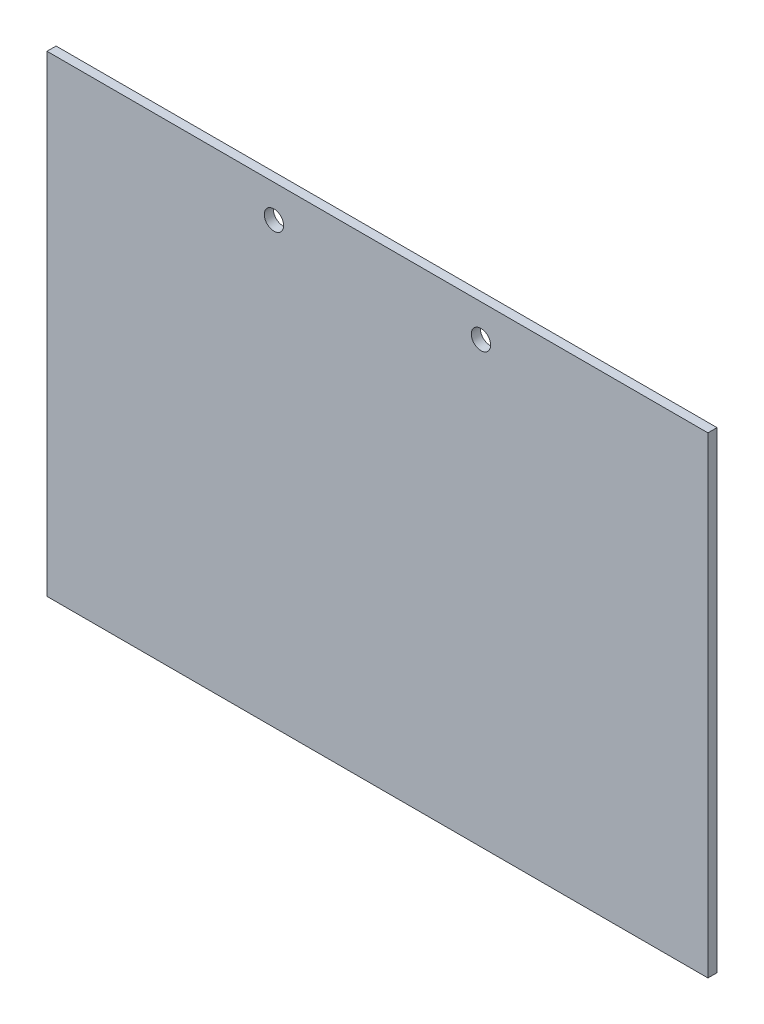
ISO-10303-21;
HEADER;
FILE_DESCRIPTION(('STEP AP214'),'2;1');
FILE_NAME('part.step','',(''),(''),'','','');
FILE_SCHEMA(('AUTOMOTIVE_DESIGN { 1 0 10303 214 1 1 1 1 }'));
ENDSEC;
DATA;
#1=APPLICATION_CONTEXT('core data for automotive mechanical design processes');
#2=APPLICATION_PROTOCOL_DEFINITION('international standard','automotive_design',2000,#1);
#3=PRODUCT_CONTEXT('',#1,'mechanical');
#4=PRODUCT('Part','Part','',(#3));
#5=PRODUCT_RELATED_PRODUCT_CATEGORY('part','',(#4));
#6=PRODUCT_DEFINITION_FORMATION('','',#4);
#7=PRODUCT_DEFINITION_CONTEXT('part definition',#1,'design');
#8=PRODUCT_DEFINITION('design','',#6,#7);
#9=PRODUCT_DEFINITION_SHAPE('','',#8);
#10=(LENGTH_UNIT() NAMED_UNIT(*) SI_UNIT(.MILLI.,.METRE.));
#11=(NAMED_UNIT(*) PLANE_ANGLE_UNIT() SI_UNIT($,.RADIAN.));
#12=(NAMED_UNIT(*) SI_UNIT($,.STERADIAN.) SOLID_ANGLE_UNIT());
#13=UNCERTAINTY_MEASURE_WITH_UNIT(LENGTH_MEASURE(1.E-05),#10,'distance_accuracy_value','');
#14=(GEOMETRIC_REPRESENTATION_CONTEXT(3) GLOBAL_UNCERTAINTY_ASSIGNED_CONTEXT((#13)) GLOBAL_UNIT_ASSIGNED_CONTEXT((#10,
#11,#12)) REPRESENTATION_CONTEXT('',''));
#15=CARTESIAN_POINT('',(0.,0.,0.));
#16=DIRECTION('',(0.,0.,1.));
#17=DIRECTION('',(1.,0.,0.));
#18=AXIS2_PLACEMENT_3D('',#15,#16,#17);
#19=CARTESIAN_POINT('',(0.,0.,3.175));
#20=DIRECTION('',(1.,0.,0.));
#21=DIRECTION('',(0.,1.,0.));
#22=AXIS2_PLACEMENT_3D('',#19,#20,#21);
#23=PLANE('',#22);
#24=DIRECTION('',(0.,-1.,0.));
#25=VECTOR('',#24,1.);
#26=CARTESIAN_POINT('',(0.,0.,0.));
#27=LINE('',#26,#25);
#28=CARTESIAN_POINT('',(0.,0.,0.));
#29=VERTEX_POINT('',#28);
#30=CARTESIAN_POINT('',(0.,-165.1,0.));
#31=VERTEX_POINT('',#30);
#32=EDGE_CURVE('E95',#29,#31,#27,.T.);
#33=ORIENTED_EDGE('',*,*,#32,.T.);
#34=DIRECTION('',(0.,0.,-1.));
#35=VECTOR('',#34,1.);
#36=CARTESIAN_POINT('',(0.,-165.1,3.175));
#37=LINE('',#36,#35);
#38=CARTESIAN_POINT('',(0.,-165.1,3.175));
#39=VERTEX_POINT('',#38);
#40=EDGE_CURVE('E11',#39,#31,#37,.T.);
#41=ORIENTED_EDGE('',*,*,#40,.F.);
#42=DIRECTION('',(0.,-1.,0.));
#43=VECTOR('',#42,1.);
#44=CARTESIAN_POINT('',(0.,0.,3.175));
#45=LINE('',#44,#43);
#46=CARTESIAN_POINT('',(0.,0.,3.175));
#47=VERTEX_POINT('',#46);
#48=EDGE_CURVE('E83',#47,#39,#45,.T.);
#49=ORIENTED_EDGE('',*,*,#48,.F.);
#50=DIRECTION('',(0.,0.,-1.));
#51=VECTOR('',#50,1.);
#52=CARTESIAN_POINT('',(0.,0.,3.175));
#53=LINE('',#52,#51);
#54=EDGE_CURVE('E91',#47,#29,#53,.T.);
#55=ORIENTED_EDGE('',*,*,#54,.T.);
#56=EDGE_LOOP('',(#33,#41,#49,#55));
#57=FACE_BOUND('',#56,.T.);
#58=ADVANCED_FACE('F32',(#57),#23,.F.);
#59=CARTESIAN_POINT('',(0.,-165.1,3.175));
#60=DIRECTION('',(0.,1.,0.));
#61=DIRECTION('',(0.,0.,1.));
#62=AXIS2_PLACEMENT_3D('',#59,#60,#61);
#63=PLANE('',#62);
#64=DIRECTION('',(1.,0.,0.));
#65=VECTOR('',#64,1.);
#66=CARTESIAN_POINT('',(0.,-165.1,0.));
#67=LINE('',#66,#65);
#68=CARTESIAN_POINT('',(231.14,-165.1,0.));
#69=VERTEX_POINT('',#68);
#70=EDGE_CURVE('E87',#31,#69,#67,.T.);
#71=ORIENTED_EDGE('',*,*,#70,.T.);
#72=DIRECTION('',(0.,0.,-1.));
#73=VECTOR('',#72,1.);
#74=CARTESIAN_POINT('',(231.14,-165.1,3.175));
#75=LINE('',#74,#73);
#76=CARTESIAN_POINT('',(231.14,-165.1,3.175));
#77=VERTEX_POINT('',#76);
#78=EDGE_CURVE('E40',#77,#69,#75,.T.);
#79=ORIENTED_EDGE('',*,*,#78,.F.);
#80=DIRECTION('',(1.,0.,0.));
#81=VECTOR('',#80,1.);
#82=CARTESIAN_POINT('',(0.,-165.1,3.175));
#83=LINE('',#82,#81);
#84=EDGE_CURVE('E78',#39,#77,#83,.T.);
#85=ORIENTED_EDGE('',*,*,#84,.F.);
#86=ORIENTED_EDGE('',*,*,#40,.T.);
#87=EDGE_LOOP('',(#71,#79,#85,#86));
#88=FACE_BOUND('',#87,.T.);
#89=ADVANCED_FACE('F86',(#88),#63,.F.);
#90=CARTESIAN_POINT('',(231.14,0.,3.175));
#91=DIRECTION('',(-1.,0.,0.));
#92=DIRECTION('',(0.,-1.,0.));
#93=AXIS2_PLACEMENT_3D('',#90,#91,#92);
#94=PLANE('',#93);
#95=DIRECTION('',(0.,1.,0.));
#96=VECTOR('',#95,1.);
#97=CARTESIAN_POINT('',(231.14,0.,0.));
#98=LINE('',#97,#96);
#99=CARTESIAN_POINT('',(231.14,0.,0.));
#100=VERTEX_POINT('',#99);
#101=EDGE_CURVE('E65',#69,#100,#98,.T.);
#102=ORIENTED_EDGE('',*,*,#101,.T.);
#103=DIRECTION('',(0.,0.,-1.));
#104=VECTOR('',#103,1.);
#105=CARTESIAN_POINT('',(231.14,0.,3.175));
#106=LINE('',#105,#104);
#107=CARTESIAN_POINT('',(231.14,0.,3.175));
#108=VERTEX_POINT('',#107);
#109=EDGE_CURVE('E88',#108,#100,#106,.T.);
#110=ORIENTED_EDGE('',*,*,#109,.F.);
#111=DIRECTION('',(0.,1.,0.));
#112=VECTOR('',#111,1.);
#113=CARTESIAN_POINT('',(231.14,0.,3.175));
#114=LINE('',#113,#112);
#115=EDGE_CURVE('E81',#77,#108,#114,.T.);
#116=ORIENTED_EDGE('',*,*,#115,.F.);
#117=ORIENTED_EDGE('',*,*,#78,.T.);
#118=EDGE_LOOP('',(#102,#110,#116,#117));
#119=FACE_BOUND('',#118,.T.);
#120=ADVANCED_FACE('F89',(#119),#94,.F.);
#121=CARTESIAN_POINT('',(0.,0.,3.175));
#122=DIRECTION('',(0.,-1.,0.));
#123=DIRECTION('',(0.,0.,-1.));
#124=AXIS2_PLACEMENT_3D('',#121,#122,#123);
#125=PLANE('',#124);
#126=DIRECTION('',(-1.,0.,0.));
#127=VECTOR('',#126,1.);
#128=CARTESIAN_POINT('',(0.,0.,0.));
#129=LINE('',#128,#127);
#130=EDGE_CURVE('E71',#100,#29,#129,.T.);
#131=ORIENTED_EDGE('',*,*,#130,.T.);
#132=ORIENTED_EDGE('',*,*,#54,.F.);
#133=DIRECTION('',(-1.,0.,0.));
#134=VECTOR('',#133,1.);
#135=CARTESIAN_POINT('',(0.,0.,3.175));
#136=LINE('',#135,#134);
#137=EDGE_CURVE('E48',#108,#47,#136,.T.);
#138=ORIENTED_EDGE('',*,*,#137,.F.);
#139=ORIENTED_EDGE('',*,*,#109,.T.);
#140=EDGE_LOOP('',(#131,#132,#138,#139));
#141=FACE_BOUND('',#140,.T.);
#142=ADVANCED_FACE('F103',(#141),#125,.F.);
#143=CARTESIAN_POINT('',(0.,0.,3.175));
#144=DIRECTION('',(0.,0.,1.));
#145=DIRECTION('',(1.,0.,0.));
#146=AXIS2_PLACEMENT_3D('',#143,#144,#145);
#147=PLANE('',#146);
#148=CARTESIAN_POINT('',(79.375,-11.43,3.175));
#149=DIRECTION('',(0.,0.,1.));
#150=DIRECTION('',(1.,0.,0.));
#151=AXIS2_PLACEMENT_3D('',#148,#149,#150);
#152=CIRCLE('',#151,3.37819999999998);
#153=CARTESIAN_POINT('',(82.7532,-11.43,3.175));
#154=VERTEX_POINT('',#153);
#155=EDGE_CURVE('E117',#154,#154,#152,.T.);
#156=ORIENTED_EDGE('',*,*,#155,.F.);
#157=EDGE_LOOP('',(#156));
#158=FACE_BOUND('',#157,.T.);
#159=CARTESIAN_POINT('',(151.765,-11.43,3.175));
#160=DIRECTION('',(0.,0.,1.));
#161=DIRECTION('',(1.,0.,0.));
#162=AXIS2_PLACEMENT_3D('',#159,#160,#161);
#163=CIRCLE('',#162,3.3782);
#164=CARTESIAN_POINT('',(155.1432,-11.43,3.175));
#165=VERTEX_POINT('',#164);
#166=EDGE_CURVE('E111',#165,#165,#163,.T.);
#167=ORIENTED_EDGE('',*,*,#166,.F.);
#168=EDGE_LOOP('',(#167));
#169=FACE_BOUND('',#168,.T.);
#170=ORIENTED_EDGE('',*,*,#48,.T.);
#171=ORIENTED_EDGE('',*,*,#84,.T.);
#172=ORIENTED_EDGE('',*,*,#115,.T.);
#173=ORIENTED_EDGE('',*,*,#137,.T.);
#174=EDGE_LOOP('',(#170,#171,#172,#173));
#175=FACE_BOUND('',#174,.T.);
#176=ADVANCED_FACE('F79',(#158,#169,#175),#147,.T.);
#177=CARTESIAN_POINT('',(0.,0.,0.));
#178=DIRECTION('',(0.,0.,1.));
#179=DIRECTION('',(1.,0.,0.));
#180=AXIS2_PLACEMENT_3D('',#177,#178,#179);
#181=PLANE('',#180);
#182=CARTESIAN_POINT('',(79.375,-11.43,0.));
#183=DIRECTION('',(0.,0.,1.));
#184=DIRECTION('',(1.,0.,0.));
#185=AXIS2_PLACEMENT_3D('',#182,#183,#184);
#186=CIRCLE('',#185,3.3782);
#187=CARTESIAN_POINT('',(82.7532,-11.43,0.));
#188=VERTEX_POINT('',#187);
#189=EDGE_CURVE('E114',#188,#188,#186,.T.);
#190=ORIENTED_EDGE('',*,*,#189,.T.);
#191=EDGE_LOOP('',(#190));
#192=FACE_BOUND('',#191,.T.);
#193=CARTESIAN_POINT('',(151.765,-11.43,0.));
#194=DIRECTION('',(0.,0.,1.));
#195=DIRECTION('',(1.,0.,0.));
#196=AXIS2_PLACEMENT_3D('',#193,#194,#195);
#197=CIRCLE('',#196,3.3782);
#198=CARTESIAN_POINT('',(155.1432,-11.43,0.));
#199=VERTEX_POINT('',#198);
#200=EDGE_CURVE('E98',#199,#199,#197,.T.);
#201=ORIENTED_EDGE('',*,*,#200,.T.);
#202=EDGE_LOOP('',(#201));
#203=FACE_BOUND('',#202,.T.);
#204=ORIENTED_EDGE('',*,*,#32,.F.);
#205=ORIENTED_EDGE('',*,*,#130,.F.);
#206=ORIENTED_EDGE('',*,*,#101,.F.);
#207=ORIENTED_EDGE('',*,*,#70,.F.);
#208=EDGE_LOOP('',(#204,#205,#206,#207));
#209=FACE_BOUND('',#208,.T.);
#210=ADVANCED_FACE('F106',(#192,#203,#209),#181,.F.);
#211=CARTESIAN_POINT('',(151.765,-11.43,3.175));
#212=DIRECTION('',(0.,0.,1.));
#213=DIRECTION('',(1.,0.,0.));
#214=AXIS2_PLACEMENT_3D('',#211,#212,#213);
#215=CYLINDRICAL_SURFACE('',#214,3.3782);
#216=ORIENTED_EDGE('',*,*,#200,.F.);
#217=EDGE_LOOP('',(#216));
#218=FACE_BOUND('',#217,.T.);
#219=ORIENTED_EDGE('',*,*,#166,.T.);
#220=EDGE_LOOP('',(#219));
#221=FACE_BOUND('',#220,.T.);
#222=ADVANCED_FACE('F128',(#218,#221),#215,.F.);
#223=CARTESIAN_POINT('',(79.375,-11.43,3.175));
#224=DIRECTION('',(0.,0.,1.));
#225=DIRECTION('',(1.,0.,0.));
#226=AXIS2_PLACEMENT_3D('',#223,#224,#225);
#227=CYLINDRICAL_SURFACE('',#226,3.37819999999999);
#228=ORIENTED_EDGE('',*,*,#189,.F.);
#229=EDGE_LOOP('',(#228));
#230=FACE_BOUND('',#229,.T.);
#231=ORIENTED_EDGE('',*,*,#155,.T.);
#232=EDGE_LOOP('',(#231));
#233=FACE_BOUND('',#232,.T.);
#234=ADVANCED_FACE('F121',(#230,#233),#227,.F.);
#235=CLOSED_SHELL('',(#58,#89,#120,#142,#176,#210,#222,#234));
#236=MANIFOLD_SOLID_BREP('B2',#235);
#237=ADVANCED_BREP_SHAPE_REPRESENTATION('',(#18,#236),#14);
#238=SHAPE_DEFINITION_REPRESENTATION(#9,#237);
ENDSEC;
END-ISO-10303-21;
